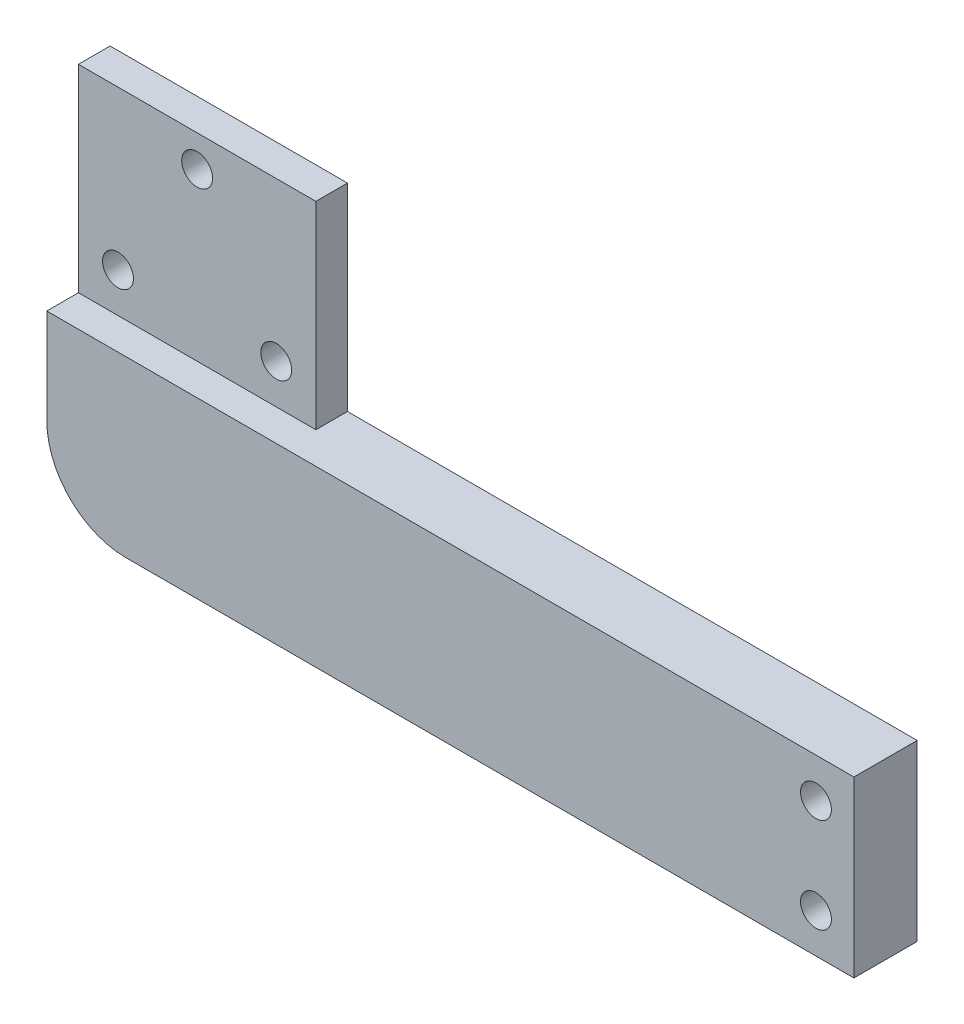
ISO-10303-21;
HEADER;
FILE_DESCRIPTION(('STEP AP214'),'2;1');
FILE_NAME('part.step','',(''),(''),'','','');
FILE_SCHEMA(('AUTOMOTIVE_DESIGN { 1 0 10303 214 1 1 1 1 }'));
ENDSEC;
DATA;
#1=APPLICATION_CONTEXT('core data for automotive mechanical design processes');
#2=APPLICATION_PROTOCOL_DEFINITION('international standard','automotive_design',2000,#1);
#3=PRODUCT_CONTEXT('',#1,'mechanical');
#4=PRODUCT('Part','Part','',(#3));
#5=PRODUCT_RELATED_PRODUCT_CATEGORY('part','',(#4));
#6=PRODUCT_DEFINITION_FORMATION('','',#4);
#7=PRODUCT_DEFINITION_CONTEXT('part definition',#1,'design');
#8=PRODUCT_DEFINITION('design','',#6,#7);
#9=PRODUCT_DEFINITION_SHAPE('','',#8);
#10=(LENGTH_UNIT() NAMED_UNIT(*) SI_UNIT(.MILLI.,.METRE.));
#11=(NAMED_UNIT(*) PLANE_ANGLE_UNIT() SI_UNIT($,.RADIAN.));
#12=(NAMED_UNIT(*) SI_UNIT($,.STERADIAN.) SOLID_ANGLE_UNIT());
#13=UNCERTAINTY_MEASURE_WITH_UNIT(LENGTH_MEASURE(1.E-05),#10,'distance_accuracy_value','');
#14=(GEOMETRIC_REPRESENTATION_CONTEXT(3) GLOBAL_UNCERTAINTY_ASSIGNED_CONTEXT((#13)) GLOBAL_UNIT_ASSIGNED_CONTEXT((#10,
#11,#12)) REPRESENTATION_CONTEXT('',''));
#15=CARTESIAN_POINT('',(0.,0.,0.));
#16=DIRECTION('',(0.,0.,1.));
#17=DIRECTION('',(1.,0.,0.));
#18=AXIS2_PLACEMENT_3D('',#15,#16,#17);
#19=CARTESIAN_POINT('',(51.,11.,8.));
#20=DIRECTION('',(0.,-1.,0.));
#21=DIRECTION('',(1.,0.,0.));
#22=AXIS2_PLACEMENT_3D('',#19,#20,#21);
#23=PLANE('',#22);
#24=DIRECTION('',(0.,0.,-1.));
#25=VECTOR('',#24,1.);
#26=CARTESIAN_POINT('',(-21.,11.,8.));
#27=LINE('',#26,#25);
#28=CARTESIAN_POINT('',(-21.,11.,4.));
#29=VERTEX_POINT('',#28);
#30=CARTESIAN_POINT('',(-21.,11.,0.));
#31=VERTEX_POINT('',#30);
#32=EDGE_CURVE('E34',#29,#31,#27,.T.);
#33=ORIENTED_EDGE('',*,*,#32,.F.);
#34=DIRECTION('',(1.,0.,0.));
#35=VECTOR('',#34,1.);
#36=CARTESIAN_POINT('',(-21.,11.,4.));
#37=LINE('',#36,#35);
#38=CARTESIAN_POINT('',(-51.,11.,4.));
#39=VERTEX_POINT('',#38);
#40=EDGE_CURVE('E112',#39,#29,#37,.T.);
#41=ORIENTED_EDGE('',*,*,#40,.F.);
#42=DIRECTION('',(0.,0.,1.));
#43=VECTOR('',#42,1.);
#44=CARTESIAN_POINT('',(-51.,11.,4.));
#45=LINE('',#44,#43);
#46=CARTESIAN_POINT('',(-51.,11.,8.));
#47=VERTEX_POINT('',#46);
#48=EDGE_CURVE('E111',#39,#47,#45,.T.);
#49=ORIENTED_EDGE('',*,*,#48,.T.);
#50=DIRECTION('',(-1.,0.,0.));
#51=VECTOR('',#50,1.);
#52=CARTESIAN_POINT('',(51.,11.,8.));
#53=LINE('',#52,#51);
#54=CARTESIAN_POINT('',(51.,11.,8.));
#55=VERTEX_POINT('',#54);
#56=EDGE_CURVE('E137',#55,#47,#53,.T.);
#57=ORIENTED_EDGE('',*,*,#56,.F.);
#58=DIRECTION('',(0.,0.,-1.));
#59=VECTOR('',#58,1.);
#60=CARTESIAN_POINT('',(51.,11.,8.));
#61=LINE('',#60,#59);
#62=CARTESIAN_POINT('',(51.,11.,0.));
#63=VERTEX_POINT('',#62);
#64=EDGE_CURVE('E157',#55,#63,#61,.T.);
#65=ORIENTED_EDGE('',*,*,#64,.T.);
#66=DIRECTION('',(-1.,0.,0.));
#67=VECTOR('',#66,1.);
#68=CARTESIAN_POINT('',(51.,11.,0.));
#69=LINE('',#68,#67);
#70=EDGE_CURVE('E145',#63,#31,#69,.T.);
#71=ORIENTED_EDGE('',*,*,#70,.T.);
#72=EDGE_LOOP('',(#33,#41,#49,#57,#65,#71));
#73=FACE_BOUND('',#72,.T.);
#74=ADVANCED_FACE('F30',(#73),#23,.F.);
#75=CARTESIAN_POINT('',(51.,11.,8.));
#76=DIRECTION('',(-1.,0.,0.));
#77=DIRECTION('',(0.,0.,1.));
#78=AXIS2_PLACEMENT_3D('',#75,#76,#77);
#79=PLANE('',#78);
#80=DIRECTION('',(0.,1.,0.));
#81=VECTOR('',#80,1.);
#82=CARTESIAN_POINT('',(51.,11.,0.));
#83=LINE('',#82,#81);
#84=CARTESIAN_POINT('',(51.,-11.,0.));
#85=VERTEX_POINT('',#84);
#86=EDGE_CURVE('E252',#85,#63,#83,.T.);
#87=ORIENTED_EDGE('',*,*,#86,.T.);
#88=ORIENTED_EDGE('',*,*,#64,.F.);
#89=DIRECTION('',(0.,1.,0.));
#90=VECTOR('',#89,1.);
#91=CARTESIAN_POINT('',(51.,11.,8.));
#92=LINE('',#91,#90);
#93=CARTESIAN_POINT('',(51.,-11.,8.));
#94=VERTEX_POINT('',#93);
#95=EDGE_CURVE('E134',#94,#55,#92,.T.);
#96=ORIENTED_EDGE('',*,*,#95,.F.);
#97=DIRECTION('',(0.,0.,-1.));
#98=VECTOR('',#97,1.);
#99=CARTESIAN_POINT('',(51.,-11.,8.));
#100=LINE('',#99,#98);
#101=EDGE_CURVE('E259',#94,#85,#100,.T.);
#102=ORIENTED_EDGE('',*,*,#101,.T.);
#103=EDGE_LOOP('',(#87,#88,#96,#102));
#104=FACE_BOUND('',#103,.T.);
#105=ADVANCED_FACE('F195',(#104),#79,.F.);
#106=CARTESIAN_POINT('',(-51.,11.,8.));
#107=DIRECTION('',(1.,0.,0.));
#108=DIRECTION('',(0.,0.,-1.));
#109=AXIS2_PLACEMENT_3D('',#106,#107,#108);
#110=PLANE('',#109);
#111=DIRECTION('',(0.,-1.,0.));
#112=VECTOR('',#111,1.);
#113=CARTESIAN_POINT('',(-51.,11.,8.));
#114=LINE('',#113,#112);
#115=CARTESIAN_POINT('',(-51.,-1.00000000000001,8.));
#116=VERTEX_POINT('',#115);
#117=EDGE_CURVE('E55',#47,#116,#114,.T.);
#118=ORIENTED_EDGE('',*,*,#117,.F.);
#119=ORIENTED_EDGE('',*,*,#48,.F.);
#120=DIRECTION('',(0.,-1.,0.));
#121=VECTOR('',#120,1.);
#122=CARTESIAN_POINT('',(-51.,36.,4.));
#123=LINE('',#122,#121);
#124=CARTESIAN_POINT('',(-51.,36.,4.));
#125=VERTEX_POINT('',#124);
#126=EDGE_CURVE('E98',#125,#39,#123,.T.);
#127=ORIENTED_EDGE('',*,*,#126,.F.);
#128=DIRECTION('',(0.,0.,-1.));
#129=VECTOR('',#128,1.);
#130=CARTESIAN_POINT('',(-51.,36.,8.));
#131=LINE('',#130,#129);
#132=CARTESIAN_POINT('',(-51.,36.,0.));
#133=VERTEX_POINT('',#132);
#134=EDGE_CURVE('E108',#125,#133,#131,.T.);
#135=ORIENTED_EDGE('',*,*,#134,.T.);
#136=DIRECTION('',(0.,-1.,0.));
#137=VECTOR('',#136,1.);
#138=CARTESIAN_POINT('',(-51.,11.,0.));
#139=LINE('',#138,#137);
#140=CARTESIAN_POINT('',(-51.,-1.00000000000001,0.));
#141=VERTEX_POINT('',#140);
#142=EDGE_CURVE('E255',#133,#141,#139,.T.);
#143=ORIENTED_EDGE('',*,*,#142,.T.);
#144=DIRECTION('',(0.,0.,-1.));
#145=VECTOR('',#144,1.);
#146=CARTESIAN_POINT('',(-51.,-1.00000000000001,8.));
#147=LINE('',#146,#145);
#148=EDGE_CURVE('E40',#141,#116,#147,.F.);
#149=ORIENTED_EDGE('',*,*,#148,.T.);
#150=EDGE_LOOP('',(#118,#119,#127,#135,#143,#149));
#151=FACE_BOUND('',#150,.T.);
#152=ADVANCED_FACE('F106',(#151),#110,.F.);
#153=CARTESIAN_POINT('',(51.,-11.,8.));
#154=DIRECTION('',(0.,1.,0.));
#155=DIRECTION('',(-1.,0.,0.));
#156=AXIS2_PLACEMENT_3D('',#153,#154,#155);
#157=PLANE('',#156);
#158=DIRECTION('',(1.,0.,0.));
#159=VECTOR('',#158,1.);
#160=CARTESIAN_POINT('',(51.,-11.,8.));
#161=LINE('',#160,#159);
#162=CARTESIAN_POINT('',(-41.,-11.,8.));
#163=VERTEX_POINT('',#162);
#164=EDGE_CURVE('E261',#163,#94,#161,.T.);
#165=ORIENTED_EDGE('',*,*,#164,.F.);
#166=DIRECTION('',(0.,0.,-1.));
#167=VECTOR('',#166,1.);
#168=CARTESIAN_POINT('',(-41.,-11.,8.));
#169=LINE('',#168,#167);
#170=CARTESIAN_POINT('',(-41.,-11.,0.));
#171=VERTEX_POINT('',#170);
#172=EDGE_CURVE('E153',#163,#171,#169,.T.);
#173=ORIENTED_EDGE('',*,*,#172,.T.);
#174=DIRECTION('',(1.,0.,0.));
#175=VECTOR('',#174,1.);
#176=CARTESIAN_POINT('',(51.,-11.,0.));
#177=LINE('',#176,#175);
#178=EDGE_CURVE('E138',#171,#85,#177,.T.);
#179=ORIENTED_EDGE('',*,*,#178,.T.);
#180=ORIENTED_EDGE('',*,*,#101,.F.);
#181=EDGE_LOOP('',(#165,#173,#179,#180));
#182=FACE_BOUND('',#181,.T.);
#183=ADVANCED_FACE('F205',(#182),#157,.F.);
#184=CARTESIAN_POINT('',(51.,-11.,8.));
#185=DIRECTION('',(0.,0.,-1.));
#186=DIRECTION('',(-1.,0.,0.));
#187=AXIS2_PLACEMENT_3D('',#184,#185,#186);
#188=PLANE('',#187);
#189=CARTESIAN_POINT('',(46.2,6.,8.));
#190=DIRECTION('',(0.,0.,1.));
#191=DIRECTION('',(1.,0.,0.));
#192=AXIS2_PLACEMENT_3D('',#189,#190,#191);
#193=CIRCLE('',#192,1.94999999999999);
#194=CARTESIAN_POINT('',(48.15,6.,8.));
#195=VERTEX_POINT('',#194);
#196=EDGE_CURVE('E126',#195,#195,#193,.T.);
#197=ORIENTED_EDGE('',*,*,#196,.F.);
#198=EDGE_LOOP('',(#197));
#199=FACE_BOUND('',#198,.T.);
#200=CARTESIAN_POINT('',(46.2,-6.,8.));
#201=DIRECTION('',(0.,0.,1.));
#202=DIRECTION('',(1.,0.,0.));
#203=AXIS2_PLACEMENT_3D('',#200,#201,#202);
#204=CIRCLE('',#203,1.94999999999999);
#205=CARTESIAN_POINT('',(48.15,-6.,8.));
#206=VERTEX_POINT('',#205);
#207=EDGE_CURVE('E130',#206,#206,#204,.T.);
#208=ORIENTED_EDGE('',*,*,#207,.F.);
#209=EDGE_LOOP('',(#208));
#210=FACE_BOUND('',#209,.T.);
#211=ORIENTED_EDGE('',*,*,#56,.T.);
#212=ORIENTED_EDGE('',*,*,#117,.T.);
#213=CARTESIAN_POINT('',(-41.,-1.00000000000001,8.));
#214=DIRECTION('',(0.,0.,-1.));
#215=DIRECTION('',(-1.,0.,0.));
#216=AXIS2_PLACEMENT_3D('',#213,#214,#215);
#217=CIRCLE('',#216,10.);
#218=EDGE_CURVE('E11',#116,#163,#217,.F.);
#219=ORIENTED_EDGE('',*,*,#218,.T.);
#220=ORIENTED_EDGE('',*,*,#164,.T.);
#221=ORIENTED_EDGE('',*,*,#95,.T.);
#222=EDGE_LOOP('',(#211,#212,#219,#220,#221));
#223=FACE_BOUND('',#222,.T.);
#224=ADVANCED_FACE('F208',(#199,#210,#223),#188,.F.);
#225=CARTESIAN_POINT('',(51.,-11.,0.));
#226=DIRECTION('',(0.,0.,-1.));
#227=DIRECTION('',(-1.,0.,0.));
#228=AXIS2_PLACEMENT_3D('',#225,#226,#227);
#229=PLANE('',#228);
#230=CARTESIAN_POINT('',(-46.,16.,0.));
#231=DIRECTION('',(0.,0.,-1.));
#232=DIRECTION('',(-1.,0.,0.));
#233=AXIS2_PLACEMENT_3D('',#230,#231,#232);
#234=CIRCLE('',#233,1.94999999999999);
#235=CARTESIAN_POINT('',(-47.95,16.,0.));
#236=VERTEX_POINT('',#235);
#237=EDGE_CURVE('E165',#236,#236,#234,.T.);
#238=ORIENTED_EDGE('',*,*,#237,.F.);
#239=EDGE_LOOP('',(#238));
#240=FACE_BOUND('',#239,.T.);
#241=CARTESIAN_POINT('',(-26.,16.,0.));
#242=DIRECTION('',(0.,0.,-1.));
#243=DIRECTION('',(-1.,0.,0.));
#244=AXIS2_PLACEMENT_3D('',#241,#242,#243);
#245=CIRCLE('',#244,1.94999999999999);
#246=CARTESIAN_POINT('',(-27.95,16.,0.));
#247=VERTEX_POINT('',#246);
#248=EDGE_CURVE('E162',#247,#247,#245,.T.);
#249=ORIENTED_EDGE('',*,*,#248,.F.);
#250=EDGE_LOOP('',(#249));
#251=FACE_BOUND('',#250,.T.);
#252=CARTESIAN_POINT('',(-36.,32.,0.));
#253=DIRECTION('',(0.,0.,-1.));
#254=DIRECTION('',(-1.,0.,0.));
#255=AXIS2_PLACEMENT_3D('',#252,#253,#254);
#256=CIRCLE('',#255,1.94999999999999);
#257=CARTESIAN_POINT('',(-37.95,32.,0.));
#258=VERTEX_POINT('',#257);
#259=EDGE_CURVE('E150',#258,#258,#256,.T.);
#260=ORIENTED_EDGE('',*,*,#259,.F.);
#261=EDGE_LOOP('',(#260));
#262=FACE_BOUND('',#261,.T.);
#263=CARTESIAN_POINT('',(46.2,6.,0.));
#264=DIRECTION('',(0.,0.,-1.));
#265=DIRECTION('',(-1.,0.,0.));
#266=AXIS2_PLACEMENT_3D('',#263,#264,#265);
#267=CIRCLE('',#266,1.94999999999999);
#268=CARTESIAN_POINT('',(44.25,6.,0.));
#269=VERTEX_POINT('',#268);
#270=EDGE_CURVE('E129',#269,#269,#267,.T.);
#271=ORIENTED_EDGE('',*,*,#270,.F.);
#272=EDGE_LOOP('',(#271));
#273=FACE_BOUND('',#272,.T.);
#274=CARTESIAN_POINT('',(46.2,-6.,0.));
#275=DIRECTION('',(0.,0.,-1.));
#276=DIRECTION('',(-1.,0.,0.));
#277=AXIS2_PLACEMENT_3D('',#274,#275,#276);
#278=CIRCLE('',#277,1.94999999999999);
#279=CARTESIAN_POINT('',(44.25,-6.,0.));
#280=VERTEX_POINT('',#279);
#281=EDGE_CURVE('E133',#280,#280,#278,.T.);
#282=ORIENTED_EDGE('',*,*,#281,.F.);
#283=EDGE_LOOP('',(#282));
#284=FACE_BOUND('',#283,.T.);
#285=ORIENTED_EDGE('',*,*,#178,.F.);
#286=CARTESIAN_POINT('',(-41.,-1.00000000000001,0.));
#287=DIRECTION('',(0.,0.,-1.));
#288=DIRECTION('',(-1.,0.,0.));
#289=AXIS2_PLACEMENT_3D('',#286,#287,#288);
#290=CIRCLE('',#289,10.);
#291=EDGE_CURVE('E156',#171,#141,#290,.T.);
#292=ORIENTED_EDGE('',*,*,#291,.T.);
#293=ORIENTED_EDGE('',*,*,#142,.F.);
#294=DIRECTION('',(-1.,0.,0.));
#295=VECTOR('',#294,1.);
#296=CARTESIAN_POINT('',(-51.,36.,0.));
#297=LINE('',#296,#295);
#298=CARTESIAN_POINT('',(-21.,36.,0.));
#299=VERTEX_POINT('',#298);
#300=EDGE_CURVE('E117',#299,#133,#297,.T.);
#301=ORIENTED_EDGE('',*,*,#300,.F.);
#302=DIRECTION('',(0.,1.,0.));
#303=VECTOR('',#302,1.);
#304=CARTESIAN_POINT('',(-21.,11.,0.));
#305=LINE('',#304,#303);
#306=EDGE_CURVE('E121',#31,#299,#305,.T.);
#307=ORIENTED_EDGE('',*,*,#306,.F.);
#308=ORIENTED_EDGE('',*,*,#70,.F.);
#309=ORIENTED_EDGE('',*,*,#86,.F.);
#310=EDGE_LOOP('',(#285,#292,#293,#301,#307,#308,#309));
#311=FACE_BOUND('',#310,.T.);
#312=ADVANCED_FACE('F210',(#240,#251,#262,#273,#284,#311),#229,.T.);
#313=CARTESIAN_POINT('',(46.2,-6.,8.));
#314=DIRECTION('',(0.,0.,1.));
#315=DIRECTION('',(1.,0.,0.));
#316=AXIS2_PLACEMENT_3D('',#313,#314,#315);
#317=CYLINDRICAL_SURFACE('',#316,1.94999999999999);
#318=ORIENTED_EDGE('',*,*,#281,.T.);
#319=EDGE_LOOP('',(#318));
#320=FACE_BOUND('',#319,.T.);
#321=ORIENTED_EDGE('',*,*,#207,.T.);
#322=EDGE_LOOP('',(#321));
#323=FACE_BOUND('',#322,.T.);
#324=ADVANCED_FACE('F213',(#320,#323),#317,.F.);
#325=CARTESIAN_POINT('',(46.2,6.,8.));
#326=DIRECTION('',(0.,0.,1.));
#327=DIRECTION('',(1.,0.,0.));
#328=AXIS2_PLACEMENT_3D('',#325,#326,#327);
#329=CYLINDRICAL_SURFACE('',#328,1.94999999999999);
#330=ORIENTED_EDGE('',*,*,#270,.T.);
#331=EDGE_LOOP('',(#330));
#332=FACE_BOUND('',#331,.T.);
#333=ORIENTED_EDGE('',*,*,#196,.T.);
#334=EDGE_LOOP('',(#333));
#335=FACE_BOUND('',#334,.T.);
#336=ADVANCED_FACE('F220',(#332,#335),#329,.F.);
#337=CARTESIAN_POINT('',(-21.,11.,8.));
#338=DIRECTION('',(-1.,0.,0.));
#339=DIRECTION('',(0.,0.,1.));
#340=AXIS2_PLACEMENT_3D('',#337,#338,#339);
#341=PLANE('',#340);
#342=DIRECTION('',(0.,0.,-1.));
#343=VECTOR('',#342,1.);
#344=CARTESIAN_POINT('',(-21.,36.,8.));
#345=LINE('',#344,#343);
#346=CARTESIAN_POINT('',(-21.,36.,4.));
#347=VERTEX_POINT('',#346);
#348=EDGE_CURVE('E118',#347,#299,#345,.T.);
#349=ORIENTED_EDGE('',*,*,#348,.F.);
#350=DIRECTION('',(0.,1.,0.));
#351=VECTOR('',#350,1.);
#352=CARTESIAN_POINT('',(-21.,36.,4.));
#353=LINE('',#352,#351);
#354=EDGE_CURVE('E48',#29,#347,#353,.T.);
#355=ORIENTED_EDGE('',*,*,#354,.F.);
#356=ORIENTED_EDGE('',*,*,#32,.T.);
#357=ORIENTED_EDGE('',*,*,#306,.T.);
#358=EDGE_LOOP('',(#349,#355,#356,#357));
#359=FACE_BOUND('',#358,.T.);
#360=ADVANCED_FACE('F224',(#359),#341,.F.);
#361=CARTESIAN_POINT('',(-51.,36.,8.));
#362=DIRECTION('',(0.,-1.,0.));
#363=DIRECTION('',(0.,0.,-1.));
#364=AXIS2_PLACEMENT_3D('',#361,#362,#363);
#365=PLANE('',#364);
#366=ORIENTED_EDGE('',*,*,#134,.F.);
#367=DIRECTION('',(-1.,0.,0.));
#368=VECTOR('',#367,1.);
#369=CARTESIAN_POINT('',(-21.,36.,4.));
#370=LINE('',#369,#368);
#371=EDGE_CURVE('E94',#347,#125,#370,.T.);
#372=ORIENTED_EDGE('',*,*,#371,.F.);
#373=ORIENTED_EDGE('',*,*,#348,.T.);
#374=ORIENTED_EDGE('',*,*,#300,.T.);
#375=EDGE_LOOP('',(#366,#372,#373,#374));
#376=FACE_BOUND('',#375,.T.);
#377=ADVANCED_FACE('F115',(#376),#365,.F.);
#378=CARTESIAN_POINT('',(-41.,-1.00000000000001,8.));
#379=DIRECTION('',(0.,0.,-1.));
#380=DIRECTION('',(-1.,0.,0.));
#381=AXIS2_PLACEMENT_3D('',#378,#379,#380);
#382=CYLINDRICAL_SURFACE('',#381,10.);
#383=ORIENTED_EDGE('',*,*,#218,.F.);
#384=ORIENTED_EDGE('',*,*,#148,.F.);
#385=ORIENTED_EDGE('',*,*,#291,.F.);
#386=ORIENTED_EDGE('',*,*,#172,.F.);
#387=EDGE_LOOP('',(#383,#384,#385,#386));
#388=FACE_BOUND('',#387,.T.);
#389=ADVANCED_FACE('F32',(#388),#382,.T.);
#390=CARTESIAN_POINT('',(-36.,32.,8.));
#391=DIRECTION('',(0.,0.,1.));
#392=DIRECTION('',(1.,0.,0.));
#393=AXIS2_PLACEMENT_3D('',#390,#391,#392);
#394=CYLINDRICAL_SURFACE('',#393,1.94999999999999);
#395=CARTESIAN_POINT('',(-36.,32.,4.));
#396=DIRECTION('',(0.,0.,-1.));
#397=DIRECTION('',(-1.,0.,0.));
#398=AXIS2_PLACEMENT_3D('',#395,#396,#397);
#399=CIRCLE('',#398,1.94999999999999);
#400=CARTESIAN_POINT('',(-37.95,32.,4.));
#401=VERTEX_POINT('',#400);
#402=EDGE_CURVE('E167',#401,#401,#399,.F.);
#403=ORIENTED_EDGE('',*,*,#402,.T.);
#404=EDGE_LOOP('',(#403));
#405=FACE_BOUND('',#404,.T.);
#406=ORIENTED_EDGE('',*,*,#259,.T.);
#407=EDGE_LOOP('',(#406));
#408=FACE_BOUND('',#407,.T.);
#409=ADVANCED_FACE('F181',(#405,#408),#394,.F.);
#410=CARTESIAN_POINT('',(-26.,16.,8.));
#411=DIRECTION('',(0.,0.,1.));
#412=DIRECTION('',(1.,0.,0.));
#413=AXIS2_PLACEMENT_3D('',#410,#411,#412);
#414=CYLINDRICAL_SURFACE('',#413,1.94999999999999);
#415=CARTESIAN_POINT('',(-26.,16.,4.));
#416=DIRECTION('',(0.,0.,-1.));
#417=DIRECTION('',(-1.,0.,0.));
#418=AXIS2_PLACEMENT_3D('',#415,#416,#417);
#419=CIRCLE('',#418,1.94999999999999);
#420=CARTESIAN_POINT('',(-27.95,16.,4.));
#421=VERTEX_POINT('',#420);
#422=EDGE_CURVE('E170',#421,#421,#419,.F.);
#423=ORIENTED_EDGE('',*,*,#422,.T.);
#424=EDGE_LOOP('',(#423));
#425=FACE_BOUND('',#424,.T.);
#426=ORIENTED_EDGE('',*,*,#248,.T.);
#427=EDGE_LOOP('',(#426));
#428=FACE_BOUND('',#427,.T.);
#429=ADVANCED_FACE('F191',(#425,#428),#414,.F.);
#430=CARTESIAN_POINT('',(-46.,16.,8.));
#431=DIRECTION('',(0.,0.,1.));
#432=DIRECTION('',(1.,0.,0.));
#433=AXIS2_PLACEMENT_3D('',#430,#431,#432);
#434=CYLINDRICAL_SURFACE('',#433,1.94999999999999);
#435=CARTESIAN_POINT('',(-46.,16.,4.));
#436=DIRECTION('',(0.,0.,-1.));
#437=DIRECTION('',(-1.,0.,0.));
#438=AXIS2_PLACEMENT_3D('',#435,#436,#437);
#439=CIRCLE('',#438,1.94999999999999);
#440=CARTESIAN_POINT('',(-47.95,16.,4.));
#441=VERTEX_POINT('',#440);
#442=EDGE_CURVE('E168',#441,#441,#439,.F.);
#443=ORIENTED_EDGE('',*,*,#442,.T.);
#444=EDGE_LOOP('',(#443));
#445=FACE_BOUND('',#444,.T.);
#446=ORIENTED_EDGE('',*,*,#237,.T.);
#447=EDGE_LOOP('',(#446));
#448=FACE_BOUND('',#447,.T.);
#449=ADVANCED_FACE('F185',(#445,#448),#434,.F.);
#450=CARTESIAN_POINT('',(-21.,11.,4.));
#451=DIRECTION('',(0.,0.,-1.));
#452=DIRECTION('',(-1.,0.,0.));
#453=AXIS2_PLACEMENT_3D('',#450,#451,#452);
#454=PLANE('',#453);
#455=ORIENTED_EDGE('',*,*,#422,.F.);
#456=EDGE_LOOP('',(#455));
#457=FACE_BOUND('',#456,.T.);
#458=ORIENTED_EDGE('',*,*,#354,.T.);
#459=ORIENTED_EDGE('',*,*,#371,.T.);
#460=ORIENTED_EDGE('',*,*,#126,.T.);
#461=ORIENTED_EDGE('',*,*,#40,.T.);
#462=EDGE_LOOP('',(#458,#459,#460,#461));
#463=FACE_BOUND('',#462,.T.);
#464=ORIENTED_EDGE('',*,*,#442,.F.);
#465=EDGE_LOOP('',(#464));
#466=FACE_BOUND('',#465,.T.);
#467=ORIENTED_EDGE('',*,*,#402,.F.);
#468=EDGE_LOOP('',(#467));
#469=FACE_BOUND('',#468,.T.);
#470=ADVANCED_FACE('F96',(#457,#463,#466,#469),#454,.F.);
#471=CLOSED_SHELL('',(#74,#105,#152,#183,#224,#312,#324,#336,#360,#377,#389,#409,#429,#449,#470));
#472=MANIFOLD_SOLID_BREP('B2',#471);
#473=ADVANCED_BREP_SHAPE_REPRESENTATION('',(#18,#472),#14);
#474=SHAPE_DEFINITION_REPRESENTATION(#9,#473);
ENDSEC;
END-ISO-10303-21;
